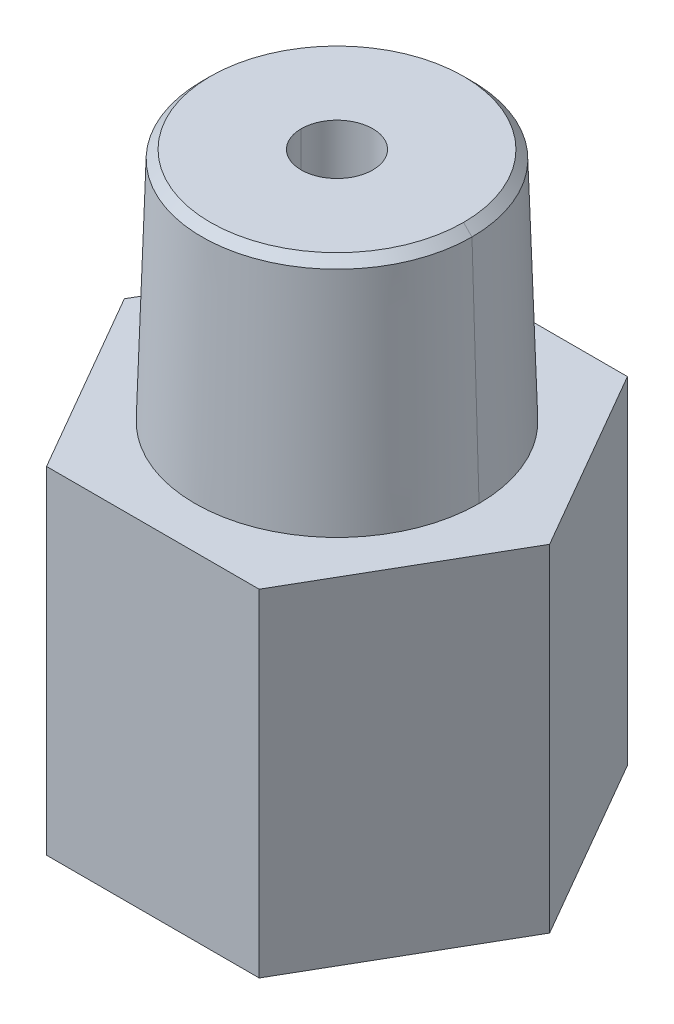
ISO-10303-21;
HEADER;
FILE_DESCRIPTION(('STEP AP214'),'2;1');
FILE_NAME('part.step','',(''),(''),'','','');
FILE_SCHEMA(('AUTOMOTIVE_DESIGN { 1 0 10303 214 1 1 1 1 }'));
ENDSEC;
DATA;
#1=APPLICATION_CONTEXT('core data for automotive mechanical design processes');
#2=APPLICATION_PROTOCOL_DEFINITION('international standard','automotive_design',2000,#1);
#3=PRODUCT_CONTEXT('',#1,'mechanical');
#4=PRODUCT('Part','Part','',(#3));
#5=PRODUCT_RELATED_PRODUCT_CATEGORY('part','',(#4));
#6=PRODUCT_DEFINITION_FORMATION('','',#4);
#7=PRODUCT_DEFINITION_CONTEXT('part definition',#1,'design');
#8=PRODUCT_DEFINITION('design','',#6,#7);
#9=PRODUCT_DEFINITION_SHAPE('','',#8);
#10=(LENGTH_UNIT() NAMED_UNIT(*) SI_UNIT(.MILLI.,.METRE.));
#11=(NAMED_UNIT(*) PLANE_ANGLE_UNIT() SI_UNIT($,.RADIAN.));
#12=(NAMED_UNIT(*) SI_UNIT($,.STERADIAN.) SOLID_ANGLE_UNIT());
#13=UNCERTAINTY_MEASURE_WITH_UNIT(LENGTH_MEASURE(1.E-05),#10,'distance_accuracy_value','');
#14=(GEOMETRIC_REPRESENTATION_CONTEXT(3) GLOBAL_UNCERTAINTY_ASSIGNED_CONTEXT((#13)) GLOBAL_UNIT_ASSIGNED_CONTEXT((#10,
#11,#12)) REPRESENTATION_CONTEXT('',''));
#15=CARTESIAN_POINT('',(0.,0.,0.));
#16=DIRECTION('',(0.,0.,1.));
#17=DIRECTION('',(1.,0.,0.));
#18=AXIS2_PLACEMENT_3D('',#15,#16,#17);
#19=CARTESIAN_POINT('',(0.,0.,0.));
#20=DIRECTION('',(0.,1.,0.));
#21=DIRECTION('',(0.,0.,1.));
#22=AXIS2_PLACEMENT_3D('',#19,#20,#21);
#23=CYLINDRICAL_SURFACE('',#22,7.1501);
#24=CARTESIAN_POINT('',(0.,15.875,0.));
#25=DIRECTION('',(0.,1.,0.));
#26=DIRECTION('',(0.,0.,1.));
#27=AXIS2_PLACEMENT_3D('',#24,#25,#26);
#28=CIRCLE('',#27,7.1501);
#29=CARTESIAN_POINT('',(-7.1501,15.875,0.));
#30=VERTEX_POINT('',#29);
#31=CARTESIAN_POINT('',(7.1501,15.875,0.));
#32=VERTEX_POINT('',#31);
#33=EDGE_CURVE('E20',#30,#32,#28,.T.);
#34=ORIENTED_EDGE('',*,*,#33,.T.);
#35=DIRECTION('',(0.,1.,0.));
#36=VECTOR('',#35,1.);
#37=CARTESIAN_POINT('',(7.1501,0.,0.));
#38=LINE('',#37,#36);
#39=CARTESIAN_POINT('',(7.15010000000084,2.36220000000018,0.));
#40=VERTEX_POINT('',#39);
#41=EDGE_CURVE('E88',#32,#40,#38,.F.);
#42=ORIENTED_EDGE('',*,*,#41,.T.);
#43=CARTESIAN_POINT('',(0.,2.36220000000024,0.));
#44=DIRECTION('',(0.,-1.,0.));
#45=DIRECTION('',(1.,0.,0.));
#46=AXIS2_PLACEMENT_3D('',#43,#44,#45);
#47=CIRCLE('',#46,7.15010000000111);
#48=CARTESIAN_POINT('',(-7.15010000000084,2.36220000000024,0.));
#49=VERTEX_POINT('',#48);
#50=EDGE_CURVE('E86',#40,#49,#47,.T.);
#51=ORIENTED_EDGE('',*,*,#50,.T.);
#52=DIRECTION('',(0.,1.,0.));
#53=VECTOR('',#52,1.);
#54=CARTESIAN_POINT('',(-7.1501,0.,0.));
#55=LINE('',#54,#53);
#56=EDGE_CURVE('E80',#49,#30,#55,.T.);
#57=ORIENTED_EDGE('',*,*,#56,.T.);
#58=EDGE_LOOP('',(#34,#42,#51,#57));
#59=FACE_BOUND('',#58,.T.);
#60=ADVANCED_FACE('F17',(#59),#23,.F.);
#61=CARTESIAN_POINT('',(0.,0.,0.));
#62=DIRECTION('',(0.,1.,0.));
#63=DIRECTION('',(0.,0.,1.));
#64=AXIS2_PLACEMENT_3D('',#61,#62,#63);
#65=CYLINDRICAL_SURFACE('',#64,7.1501);
#66=CARTESIAN_POINT('',(0.,15.875,0.));
#67=DIRECTION('',(0.,1.,0.));
#68=DIRECTION('',(0.,0.,1.));
#69=AXIS2_PLACEMENT_3D('',#66,#67,#68);
#70=CIRCLE('',#69,7.1501);
#71=EDGE_CURVE('E219',#32,#30,#70,.T.);
#72=ORIENTED_EDGE('',*,*,#71,.T.);
#73=ORIENTED_EDGE('',*,*,#56,.F.);
#74=CARTESIAN_POINT('',(0.,2.36220000000024,0.));
#75=DIRECTION('',(0.,-1.,0.));
#76=DIRECTION('',(1.,0.,0.));
#77=AXIS2_PLACEMENT_3D('',#74,#75,#76);
#78=CIRCLE('',#77,7.15010000000111);
#79=EDGE_CURVE('E215',#49,#40,#78,.T.);
#80=ORIENTED_EDGE('',*,*,#79,.T.);
#81=ORIENTED_EDGE('',*,*,#41,.F.);
#82=EDGE_LOOP('',(#72,#73,#80,#81));
#83=FACE_BOUND('',#82,.T.);
#84=ADVANCED_FACE('F240',(#83),#65,.F.);
#85=CARTESIAN_POINT('',(0.,15.875,0.));
#86=DIRECTION('',(0.,1.,0.));
#87=DIRECTION('',(0.,0.,1.));
#88=AXIS2_PLACEMENT_3D('',#85,#86,#87);
#89=PLANE('',#88);
#90=CARTESIAN_POINT('',(0.,15.875,0.));
#91=DIRECTION('',(0.,-1.,0.));
#92=DIRECTION('',(0.,0.,-1.));
#93=AXIS2_PLACEMENT_3D('',#90,#91,#92);
#94=CIRCLE('',#93,2.159);
#95=CARTESIAN_POINT('',(-2.159,15.875,0.));
#96=VERTEX_POINT('',#95);
#97=CARTESIAN_POINT('',(2.159,15.875,0.));
#98=VERTEX_POINT('',#97);
#99=EDGE_CURVE('E214',#96,#98,#94,.F.);
#100=ORIENTED_EDGE('',*,*,#99,.T.);
#101=CARTESIAN_POINT('',(0.,15.875,0.));
#102=DIRECTION('',(0.,-1.,0.));
#103=DIRECTION('',(0.,0.,-1.));
#104=AXIS2_PLACEMENT_3D('',#101,#102,#103);
#105=CIRCLE('',#104,2.159);
#106=EDGE_CURVE('E208',#98,#96,#105,.F.);
#107=ORIENTED_EDGE('',*,*,#106,.T.);
#108=EDGE_LOOP('',(#100,#107));
#109=FACE_BOUND('',#108,.T.);
#110=ORIENTED_EDGE('',*,*,#33,.F.);
#111=ORIENTED_EDGE('',*,*,#71,.F.);
#112=EDGE_LOOP('',(#110,#111));
#113=FACE_BOUND('',#112,.T.);
#114=ADVANCED_FACE('F243',(#109,#113),#89,.F.);
#115=CARTESIAN_POINT('',(0.,2.7972416050126E-13,0.));
#116=DIRECTION('',(0.,-1.,0.));
#117=DIRECTION('',(0.,0.,-1.));
#118=AXIS2_PLACEMENT_3D('',#115,#116,#117);
#119=CONICAL_SURFACE('',#118,7.65220110997794,0.20943951023928);
#120=ORIENTED_EDGE('',*,*,#50,.F.);
#121=DIRECTION('',(-0.207911690817721,0.978147600733814,0.));
#122=VECTOR('',#121,1.);
#123=CARTESIAN_POINT('',(7.40115055498958,1.1811,0.));
#124=LINE('',#123,#122);
#125=CARTESIAN_POINT('',(7.65220110997794,2.77555756156289E-13,0.));
#126=VERTEX_POINT('',#125);
#127=EDGE_CURVE('E212',#40,#126,#124,.F.);
#128=ORIENTED_EDGE('',*,*,#127,.T.);
#129=CARTESIAN_POINT('',(0.,2.77555756156289E-13,0.));
#130=DIRECTION('',(0.,-1.,0.));
#131=DIRECTION('',(0.,0.,-1.));
#132=AXIS2_PLACEMENT_3D('',#129,#130,#131);
#133=CIRCLE('',#132,7.65220110997794);
#134=CARTESIAN_POINT('',(-7.65220110997794,2.77555756156289E-13,0.));
#135=VERTEX_POINT('',#134);
#136=EDGE_CURVE('E211',#126,#135,#133,.T.);
#137=ORIENTED_EDGE('',*,*,#136,.T.);
#138=DIRECTION('',(0.207911690817721,0.978147600733814,0.));
#139=VECTOR('',#138,1.);
#140=CARTESIAN_POINT('',(-7.40115055498958,1.1811,0.));
#141=LINE('',#140,#139);
#142=EDGE_CURVE('E216',#135,#49,#141,.T.);
#143=ORIENTED_EDGE('',*,*,#142,.T.);
#144=EDGE_LOOP('',(#120,#128,#137,#143));
#145=FACE_BOUND('',#144,.T.);
#146=ADVANCED_FACE('F245',(#145),#119,.F.);
#147=CARTESIAN_POINT('',(0.,2.7972416050126E-13,0.));
#148=DIRECTION('',(0.,-1.,0.));
#149=DIRECTION('',(0.,0.,-1.));
#150=AXIS2_PLACEMENT_3D('',#147,#148,#149);
#151=CONICAL_SURFACE('',#150,7.65220110997794,0.20943951023928);
#152=ORIENTED_EDGE('',*,*,#79,.F.);
#153=ORIENTED_EDGE('',*,*,#142,.F.);
#154=CARTESIAN_POINT('',(0.,2.77555756156289E-13,0.));
#155=DIRECTION('',(0.,-1.,0.));
#156=DIRECTION('',(0.,0.,-1.));
#157=AXIS2_PLACEMENT_3D('',#154,#155,#156);
#158=CIRCLE('',#157,7.65220110997794);
#159=EDGE_CURVE('E233',#135,#126,#158,.T.);
#160=ORIENTED_EDGE('',*,*,#159,.T.);
#161=ORIENTED_EDGE('',*,*,#127,.F.);
#162=EDGE_LOOP('',(#152,#153,#160,#161));
#163=FACE_BOUND('',#162,.T.);
#164=ADVANCED_FACE('F253',(#163),#151,.F.);
#165=CARTESIAN_POINT('',(0.,34.544,0.));
#166=DIRECTION('',(0.,-1.,0.));
#167=DIRECTION('',(0.,0.,-1.));
#168=AXIS2_PLACEMENT_3D('',#165,#166,#167);
#169=CYLINDRICAL_SURFACE('',#168,2.159);
#170=CARTESIAN_POINT('',(0.,34.544,0.));
#171=DIRECTION('',(0.,-1.,0.));
#172=DIRECTION('',(0.,0.,-1.));
#173=AXIS2_PLACEMENT_3D('',#170,#171,#172);
#174=CIRCLE('',#173,2.159);
#175=CARTESIAN_POINT('',(-2.159,34.544,0.));
#176=VERTEX_POINT('',#175);
#177=CARTESIAN_POINT('',(2.159,34.544,0.));
#178=VERTEX_POINT('',#177);
#179=EDGE_CURVE('E231',#176,#178,#174,.F.);
#180=ORIENTED_EDGE('',*,*,#179,.T.);
#181=DIRECTION('',(0.,-1.,0.));
#182=VECTOR('',#181,1.);
#183=CARTESIAN_POINT('',(2.159,34.544,0.));
#184=LINE('',#183,#182);
#185=EDGE_CURVE('E207',#178,#98,#184,.T.);
#186=ORIENTED_EDGE('',*,*,#185,.T.);
#187=ORIENTED_EDGE('',*,*,#99,.F.);
#188=DIRECTION('',(0.,-1.,0.));
#189=VECTOR('',#188,1.);
#190=CARTESIAN_POINT('',(-2.159,34.544,0.));
#191=LINE('',#190,#189);
#192=EDGE_CURVE('E205',#96,#176,#191,.F.);
#193=ORIENTED_EDGE('',*,*,#192,.T.);
#194=EDGE_LOOP('',(#180,#186,#187,#193));
#195=FACE_BOUND('',#194,.T.);
#196=ADVANCED_FACE('F308',(#195),#169,.F.);
#197=CARTESIAN_POINT('',(0.,34.544,0.));
#198=DIRECTION('',(0.,-1.,0.));
#199=DIRECTION('',(0.,0.,-1.));
#200=AXIS2_PLACEMENT_3D('',#197,#198,#199);
#201=CYLINDRICAL_SURFACE('',#200,2.159);
#202=CARTESIAN_POINT('',(0.,34.544,0.));
#203=DIRECTION('',(0.,-1.,0.));
#204=DIRECTION('',(0.,0.,-1.));
#205=AXIS2_PLACEMENT_3D('',#202,#203,#204);
#206=CIRCLE('',#205,2.159);
#207=EDGE_CURVE('E228',#178,#176,#206,.F.);
#208=ORIENTED_EDGE('',*,*,#207,.T.);
#209=ORIENTED_EDGE('',*,*,#192,.F.);
#210=ORIENTED_EDGE('',*,*,#106,.F.);
#211=ORIENTED_EDGE('',*,*,#185,.F.);
#212=EDGE_LOOP('',(#208,#209,#210,#211));
#213=FACE_BOUND('',#212,.T.);
#214=ADVANCED_FACE('F304',(#213),#201,.F.);
#215=CARTESIAN_POINT('',(0.,0.,0.));
#216=DIRECTION('',(0.,1.,0.));
#217=DIRECTION('',(0.,0.,1.));
#218=AXIS2_PLACEMENT_3D('',#215,#216,#217);
#219=PLANE('',#218);
#220=ORIENTED_EDGE('',*,*,#136,.F.);
#221=ORIENTED_EDGE('',*,*,#159,.F.);
#222=EDGE_LOOP('',(#220,#221));
#223=FACE_BOUND('',#222,.T.);
#224=DIRECTION('',(-0.500000000000017,0.,0.866025403784429));
#225=VECTOR('',#224,1.);
#226=CARTESIAN_POINT('',(-6.4158048663707,0.,-11.1125));
#227=LINE('',#226,#225);
#228=CARTESIAN_POINT('',(-6.4158048663707,0.,-11.1125));
#229=VERTEX_POINT('',#228);
#230=CARTESIAN_POINT('',(-12.8316097327396,0.,-3.97970932965632E-13));
#231=VERTEX_POINT('',#230);
#232=EDGE_CURVE('E187',#229,#231,#227,.T.);
#233=ORIENTED_EDGE('',*,*,#232,.F.);
#234=DIRECTION('',(-1.,0.,0.));
#235=VECTOR('',#234,1.);
#236=CARTESIAN_POINT('',(6.4158048663707,0.,-11.1125));
#237=LINE('',#236,#235);
#238=CARTESIAN_POINT('',(6.41580486637001,0.,-11.1124999999996));
#239=VERTEX_POINT('',#238);
#240=EDGE_CURVE('E192',#239,#229,#237,.T.);
#241=ORIENTED_EDGE('',*,*,#240,.F.);
#242=DIRECTION('',(-0.500000000000017,0.,-0.866025403784429));
#243=VECTOR('',#242,1.);
#244=CARTESIAN_POINT('',(12.8316097327389,0.,0.));
#245=LINE('',#244,#243);
#246=CARTESIAN_POINT('',(12.8316097327396,0.,3.97970932965632E-13));
#247=VERTEX_POINT('',#246);
#248=EDGE_CURVE('E197',#247,#239,#245,.T.);
#249=ORIENTED_EDGE('',*,*,#248,.F.);
#250=DIRECTION('',(0.500000000000017,0.,-0.866025403784429));
#251=VECTOR('',#250,1.);
#252=CARTESIAN_POINT('',(6.4158048663707,0.,11.1125));
#253=LINE('',#252,#251);
#254=CARTESIAN_POINT('',(6.4158048663707,0.,11.1125));
#255=VERTEX_POINT('',#254);
#256=EDGE_CURVE('E202',#255,#247,#253,.T.);
#257=ORIENTED_EDGE('',*,*,#256,.F.);
#258=DIRECTION('',(1.,0.,0.));
#259=VECTOR('',#258,1.);
#260=CARTESIAN_POINT('',(-6.4158048663707,0.,11.1125));
#261=LINE('',#260,#259);
#262=CARTESIAN_POINT('',(-6.41580486637001,0.,11.1124999999996));
#263=VERTEX_POINT('',#262);
#264=EDGE_CURVE('E139',#263,#255,#261,.T.);
#265=ORIENTED_EDGE('',*,*,#264,.F.);
#266=DIRECTION('',(0.500000000000017,0.,0.866025403784429));
#267=VECTOR('',#266,1.);
#268=CARTESIAN_POINT('',(-12.8316097327389,0.,0.));
#269=LINE('',#268,#267);
#270=EDGE_CURVE('E135',#231,#263,#269,.T.);
#271=ORIENTED_EDGE('',*,*,#270,.F.);
#272=EDGE_LOOP('',(#233,#241,#249,#257,#265,#271));
#273=FACE_BOUND('',#272,.T.);
#274=ADVANCED_FACE('F300',(#223,#273),#219,.F.);
#275=CARTESIAN_POINT('',(0.,34.544,0.));
#276=DIRECTION('',(0.,-1.,0.));
#277=DIRECTION('',(0.,0.,-1.));
#278=AXIS2_PLACEMENT_3D('',#275,#276,#277);
#279=PLANE('',#278);
#280=ORIENTED_EDGE('',*,*,#179,.F.);
#281=ORIENTED_EDGE('',*,*,#207,.F.);
#282=EDGE_LOOP('',(#280,#281));
#283=FACE_BOUND('',#282,.T.);
#284=CARTESIAN_POINT('',(0.,34.544,0.));
#285=DIRECTION('',(0.,-1.,0.));
#286=DIRECTION('',(0.,0.,-1.));
#287=AXIS2_PLACEMENT_3D('',#284,#285,#286);
#288=CIRCLE('',#287,7.63824979824256);
#289=CARTESIAN_POINT('',(-7.63824979824256,34.544,0.));
#290=VERTEX_POINT('',#289);
#291=CARTESIAN_POINT('',(7.63824979824256,34.544,0.));
#292=VERTEX_POINT('',#291);
#293=EDGE_CURVE('E204',#290,#292,#288,.T.);
#294=ORIENTED_EDGE('',*,*,#293,.F.);
#295=CARTESIAN_POINT('',(0.,34.544,0.));
#296=DIRECTION('',(0.,-1.,0.));
#297=DIRECTION('',(0.,0.,-1.));
#298=AXIS2_PLACEMENT_3D('',#295,#296,#297);
#299=CIRCLE('',#298,7.63824979824256);
#300=EDGE_CURVE('E179',#292,#290,#299,.T.);
#301=ORIENTED_EDGE('',*,*,#300,.F.);
#302=EDGE_LOOP('',(#294,#301));
#303=FACE_BOUND('',#302,.T.);
#304=ADVANCED_FACE('F296',(#283,#303),#279,.F.);
#305=CARTESIAN_POINT('',(0.,34.036,0.));
#306=DIRECTION('',(0.,-1.,0.));
#307=DIRECTION('',(0.,0.,-1.));
#308=AXIS2_PLACEMENT_3D('',#305,#306,#307);
#309=CONICAL_SURFACE('',#308,8.14624979824248,0.785398163397301);
#310=ORIENTED_EDGE('',*,*,#293,.T.);
#311=DIRECTION('',(-0.707106781186443,0.707106781186652,0.));
#312=VECTOR('',#311,1.);
#313=CARTESIAN_POINT('',(7.89224979824252,34.29,0.));
#314=LINE('',#313,#312);
#315=CARTESIAN_POINT('',(8.14624979824277,34.036,0.));
#316=VERTEX_POINT('',#315);
#317=EDGE_CURVE('E173',#316,#292,#314,.T.);
#318=ORIENTED_EDGE('',*,*,#317,.F.);
#319=CARTESIAN_POINT('',(0.,34.036,0.));
#320=DIRECTION('',(0.,-1.,0.));
#321=DIRECTION('',(-1.,0.,0.));
#322=AXIS2_PLACEMENT_3D('',#319,#320,#321);
#323=CIRCLE('',#322,8.14624979824282);
#324=CARTESIAN_POINT('',(-8.14624979824274,34.036,0.));
#325=VERTEX_POINT('',#324);
#326=EDGE_CURVE('E164',#325,#316,#323,.T.);
#327=ORIENTED_EDGE('',*,*,#326,.F.);
#328=DIRECTION('',(0.707106781186443,0.707106781186652,0.));
#329=VECTOR('',#328,1.);
#330=CARTESIAN_POINT('',(-7.89224979824252,34.29,0.));
#331=LINE('',#330,#329);
#332=EDGE_CURVE('E176',#290,#325,#331,.F.);
#333=ORIENTED_EDGE('',*,*,#332,.F.);
#334=EDGE_LOOP('',(#310,#318,#327,#333));
#335=FACE_BOUND('',#334,.T.);
#336=ADVANCED_FACE('F292',(#335),#309,.T.);
#337=CARTESIAN_POINT('',(6.4158048663707,0.,11.1125));
#338=DIRECTION('',(0.866025403784429,0.,0.500000000000017));
#339=DIRECTION('',(0.500000000000017,0.,-0.866025403784429));
#340=AXIS2_PLACEMENT_3D('',#337,#338,#339);
#341=PLANE('',#340);
#342=DIRECTION('',(0.,1.,0.));
#343=VECTOR('',#342,1.);
#344=CARTESIAN_POINT('',(6.4158048663707,0.,11.1125));
#345=LINE('',#344,#343);
#346=CARTESIAN_POINT('',(6.4158048663707,20.32,11.1125));
#347=VERTEX_POINT('',#346);
#348=EDGE_CURVE('E140',#255,#347,#345,.T.);
#349=ORIENTED_EDGE('',*,*,#348,.F.);
#350=ORIENTED_EDGE('',*,*,#256,.T.);
#351=DIRECTION('',(0.,1.,0.));
#352=VECTOR('',#351,1.);
#353=CARTESIAN_POINT('',(12.8316097327389,0.,0.));
#354=LINE('',#353,#352);
#355=CARTESIAN_POINT('',(12.8316097327396,20.32,3.97970932965632E-13));
#356=VERTEX_POINT('',#355);
#357=EDGE_CURVE('E199',#356,#247,#354,.F.);
#358=ORIENTED_EDGE('',*,*,#357,.F.);
#359=DIRECTION('',(0.499999999999909,0.,-0.866025403784491));
#360=VECTOR('',#359,1.);
#361=CARTESIAN_POINT('',(6.4158048663707,20.32,11.1125));
#362=LINE('',#361,#360);
#363=EDGE_CURVE('E162',#347,#356,#362,.T.);
#364=ORIENTED_EDGE('',*,*,#363,.F.);
#365=EDGE_LOOP('',(#349,#350,#358,#364));
#366=FACE_BOUND('',#365,.T.);
#367=ADVANCED_FACE('F288',(#366),#341,.T.);
#368=CARTESIAN_POINT('',(12.8316097327389,0.,0.));
#369=DIRECTION('',(0.866025403784429,0.,-0.500000000000017));
#370=DIRECTION('',(-0.500000000000017,0.,-0.866025403784429));
#371=AXIS2_PLACEMENT_3D('',#368,#369,#370);
#372=PLANE('',#371);
#373=ORIENTED_EDGE('',*,*,#357,.T.);
#374=ORIENTED_EDGE('',*,*,#248,.T.);
#375=DIRECTION('',(0.,1.,0.));
#376=VECTOR('',#375,1.);
#377=CARTESIAN_POINT('',(6.4158048663707,0.,-11.1125));
#378=LINE('',#377,#376);
#379=CARTESIAN_POINT('',(6.41580486637001,20.32,-11.1124999999996));
#380=VERTEX_POINT('',#379);
#381=EDGE_CURVE('E194',#380,#239,#378,.F.);
#382=ORIENTED_EDGE('',*,*,#381,.F.);
#383=DIRECTION('',(-0.499999999999909,0.,-0.866025403784491));
#384=VECTOR('',#383,1.);
#385=CARTESIAN_POINT('',(12.8316097327389,20.32,0.));
#386=LINE('',#385,#384);
#387=EDGE_CURVE('E159',#356,#380,#386,.T.);
#388=ORIENTED_EDGE('',*,*,#387,.F.);
#389=EDGE_LOOP('',(#373,#374,#382,#388));
#390=FACE_BOUND('',#389,.T.);
#391=ADVANCED_FACE('F284',(#390),#372,.T.);
#392=CARTESIAN_POINT('',(6.4158048663707,0.,-11.1125));
#393=DIRECTION('',(0.,0.,-1.));
#394=DIRECTION('',(-1.,0.,0.));
#395=AXIS2_PLACEMENT_3D('',#392,#393,#394);
#396=PLANE('',#395);
#397=ORIENTED_EDGE('',*,*,#381,.T.);
#398=ORIENTED_EDGE('',*,*,#240,.T.);
#399=DIRECTION('',(0.,1.,0.));
#400=VECTOR('',#399,1.);
#401=CARTESIAN_POINT('',(-6.4158048663707,0.,-11.1125));
#402=LINE('',#401,#400);
#403=CARTESIAN_POINT('',(-6.4158048663707,20.32,-11.1125));
#404=VERTEX_POINT('',#403);
#405=EDGE_CURVE('E189',#404,#229,#402,.F.);
#406=ORIENTED_EDGE('',*,*,#405,.F.);
#407=DIRECTION('',(1.,0.,0.));
#408=VECTOR('',#407,1.);
#409=CARTESIAN_POINT('',(0.,20.32,-11.1125));
#410=LINE('',#409,#408);
#411=EDGE_CURVE('E155',#380,#404,#410,.F.);
#412=ORIENTED_EDGE('',*,*,#411,.F.);
#413=EDGE_LOOP('',(#397,#398,#406,#412));
#414=FACE_BOUND('',#413,.T.);
#415=ADVANCED_FACE('F280',(#414),#396,.T.);
#416=CARTESIAN_POINT('',(-6.4158048663707,0.,-11.1125));
#417=DIRECTION('',(-0.866025403784429,0.,-0.500000000000017));
#418=DIRECTION('',(-0.500000000000017,0.,0.866025403784429));
#419=AXIS2_PLACEMENT_3D('',#416,#417,#418);
#420=PLANE('',#419);
#421=ORIENTED_EDGE('',*,*,#405,.T.);
#422=ORIENTED_EDGE('',*,*,#232,.T.);
#423=DIRECTION('',(0.,1.,0.));
#424=VECTOR('',#423,1.);
#425=CARTESIAN_POINT('',(-12.8316097327389,0.,0.));
#426=LINE('',#425,#424);
#427=CARTESIAN_POINT('',(-12.8316097327396,20.32,-3.97970932965632E-13));
#428=VERTEX_POINT('',#427);
#429=EDGE_CURVE('E185',#428,#231,#426,.F.);
#430=ORIENTED_EDGE('',*,*,#429,.F.);
#431=DIRECTION('',(-0.499999999999909,0.,0.866025403784491));
#432=VECTOR('',#431,1.);
#433=CARTESIAN_POINT('',(-6.4158048663707,20.32,-11.1125));
#434=LINE('',#433,#432);
#435=EDGE_CURVE('E153',#404,#428,#434,.T.);
#436=ORIENTED_EDGE('',*,*,#435,.F.);
#437=EDGE_LOOP('',(#421,#422,#430,#436));
#438=FACE_BOUND('',#437,.T.);
#439=ADVANCED_FACE('F277',(#438),#420,.T.);
#440=CARTESIAN_POINT('',(-12.8316097327389,0.,0.));
#441=DIRECTION('',(-0.866025403784429,0.,0.500000000000017));
#442=DIRECTION('',(0.500000000000017,0.,0.866025403784429));
#443=AXIS2_PLACEMENT_3D('',#440,#441,#442);
#444=PLANE('',#443);
#445=ORIENTED_EDGE('',*,*,#429,.T.);
#446=ORIENTED_EDGE('',*,*,#270,.T.);
#447=DIRECTION('',(0.,1.,0.));
#448=VECTOR('',#447,1.);
#449=CARTESIAN_POINT('',(-6.4158048663707,0.,11.1125));
#450=LINE('',#449,#448);
#451=CARTESIAN_POINT('',(-6.41580486637001,20.32,11.1124999999996));
#452=VERTEX_POINT('',#451);
#453=EDGE_CURVE('E127',#452,#263,#450,.F.);
#454=ORIENTED_EDGE('',*,*,#453,.F.);
#455=DIRECTION('',(0.499999999999909,0.,0.866025403784491));
#456=VECTOR('',#455,1.);
#457=CARTESIAN_POINT('',(-12.8316097327389,20.32,0.));
#458=LINE('',#457,#456);
#459=EDGE_CURVE('E132',#428,#452,#458,.T.);
#460=ORIENTED_EDGE('',*,*,#459,.F.);
#461=EDGE_LOOP('',(#445,#446,#454,#460));
#462=FACE_BOUND('',#461,.T.);
#463=ADVANCED_FACE('F130',(#462),#444,.T.);
#464=CARTESIAN_POINT('',(-6.4158048663707,0.,11.1125));
#465=DIRECTION('',(0.,0.,1.));
#466=DIRECTION('',(1.,0.,0.));
#467=AXIS2_PLACEMENT_3D('',#464,#465,#466);
#468=PLANE('',#467);
#469=ORIENTED_EDGE('',*,*,#453,.T.);
#470=ORIENTED_EDGE('',*,*,#264,.T.);
#471=ORIENTED_EDGE('',*,*,#348,.T.);
#472=DIRECTION('',(1.,0.,0.));
#473=VECTOR('',#472,1.);
#474=CARTESIAN_POINT('',(0.,20.32,11.1125));
#475=LINE('',#474,#473);
#476=EDGE_CURVE('E144',#452,#347,#475,.T.);
#477=ORIENTED_EDGE('',*,*,#476,.F.);
#478=EDGE_LOOP('',(#469,#470,#471,#477));
#479=FACE_BOUND('',#478,.T.);
#480=ADVANCED_FACE('F145',(#479),#468,.T.);
#481=CARTESIAN_POINT('',(0.,34.036,0.));
#482=DIRECTION('',(0.,-1.,0.));
#483=DIRECTION('',(0.,0.,-1.));
#484=AXIS2_PLACEMENT_3D('',#481,#482,#483);
#485=CONICAL_SURFACE('',#484,8.14624979824248,0.785398163397301);
#486=CARTESIAN_POINT('',(0.,34.036,0.));
#487=DIRECTION('',(0.,-1.,0.));
#488=DIRECTION('',(-1.,0.,0.));
#489=AXIS2_PLACEMENT_3D('',#486,#487,#488);
#490=CIRCLE('',#489,8.14624979824282);
#491=EDGE_CURVE('E167',#316,#325,#490,.T.);
#492=ORIENTED_EDGE('',*,*,#491,.F.);
#493=ORIENTED_EDGE('',*,*,#317,.T.);
#494=ORIENTED_EDGE('',*,*,#300,.T.);
#495=ORIENTED_EDGE('',*,*,#332,.T.);
#496=EDGE_LOOP('',(#492,#493,#494,#495));
#497=FACE_BOUND('',#496,.T.);
#498=ADVANCED_FACE('F269',(#497),#485,.T.);
#499=CARTESIAN_POINT('',(0.,20.32,0.));
#500=DIRECTION('',(0.,-1.,0.));
#501=DIRECTION('',(0.,0.,-1.));
#502=AXIS2_PLACEMENT_3D('',#499,#500,#501);
#503=CONICAL_SURFACE('',#502,8.5724999999997,0.0310668606854932);
#504=DIRECTION('',(-0.0310618635640815,0.999517463895417,0.));
#505=VECTOR('',#504,1.);
#506=CARTESIAN_POINT('',(8.35937489912126,27.178,0.));
#507=LINE('',#506,#505);
#508=CARTESIAN_POINT('',(8.5724999999997,20.32,0.));
#509=VERTEX_POINT('',#508);
#510=EDGE_CURVE('E168',#509,#316,#507,.T.);
#511=ORIENTED_EDGE('',*,*,#510,.F.);
#512=CARTESIAN_POINT('',(0.,20.32,0.));
#513=DIRECTION('',(0.,-1.,0.));
#514=DIRECTION('',(0.,0.,-1.));
#515=AXIS2_PLACEMENT_3D('',#512,#513,#514);
#516=CIRCLE('',#515,8.5724999999997);
#517=CARTESIAN_POINT('',(-8.5724999999997,20.32,0.));
#518=VERTEX_POINT('',#517);
#519=EDGE_CURVE('E35',#518,#509,#516,.T.);
#520=ORIENTED_EDGE('',*,*,#519,.F.);
#521=DIRECTION('',(0.0310618635640815,0.999517463895417,0.));
#522=VECTOR('',#521,1.);
#523=CARTESIAN_POINT('',(-8.35937489912126,27.178,0.));
#524=LINE('',#523,#522);
#525=EDGE_CURVE('E26',#325,#518,#524,.F.);
#526=ORIENTED_EDGE('',*,*,#525,.F.);
#527=ORIENTED_EDGE('',*,*,#326,.T.);
#528=EDGE_LOOP('',(#511,#520,#526,#527));
#529=FACE_BOUND('',#528,.T.);
#530=ADVANCED_FACE('F263',(#529),#503,.T.);
#531=CARTESIAN_POINT('',(0.,20.32,0.));
#532=DIRECTION('',(0.,1.,0.));
#533=DIRECTION('',(0.,0.,1.));
#534=AXIS2_PLACEMENT_3D('',#531,#532,#533);
#535=PLANE('',#534);
#536=ORIENTED_EDGE('',*,*,#519,.T.);
#537=CARTESIAN_POINT('',(0.,20.32,0.));
#538=DIRECTION('',(0.,-1.,0.));
#539=DIRECTION('',(0.,0.,-1.));
#540=AXIS2_PLACEMENT_3D('',#537,#538,#539);
#541=CIRCLE('',#540,8.5724999999997);
#542=EDGE_CURVE('E11',#518,#509,#541,.F.);
#543=ORIENTED_EDGE('',*,*,#542,.F.);
#544=EDGE_LOOP('',(#536,#543));
#545=FACE_BOUND('',#544,.T.);
#546=ORIENTED_EDGE('',*,*,#459,.T.);
#547=ORIENTED_EDGE('',*,*,#476,.T.);
#548=ORIENTED_EDGE('',*,*,#363,.T.);
#549=ORIENTED_EDGE('',*,*,#387,.T.);
#550=ORIENTED_EDGE('',*,*,#411,.T.);
#551=ORIENTED_EDGE('',*,*,#435,.T.);
#552=EDGE_LOOP('',(#546,#547,#548,#549,#550,#551));
#553=FACE_BOUND('',#552,.T.);
#554=ADVANCED_FACE('F150',(#545,#553),#535,.T.);
#555=CARTESIAN_POINT('',(0.,20.32,0.));
#556=DIRECTION('',(0.,-1.,0.));
#557=DIRECTION('',(0.,0.,-1.));
#558=AXIS2_PLACEMENT_3D('',#555,#556,#557);
#559=CONICAL_SURFACE('',#558,8.5724999999997,0.0310668606854932);
#560=ORIENTED_EDGE('',*,*,#525,.T.);
#561=ORIENTED_EDGE('',*,*,#542,.T.);
#562=ORIENTED_EDGE('',*,*,#510,.T.);
#563=ORIENTED_EDGE('',*,*,#491,.T.);
#564=EDGE_LOOP('',(#560,#561,#562,#563));
#565=FACE_BOUND('',#564,.T.);
#566=ADVANCED_FACE('F256',(#565),#559,.T.);
#567=CLOSED_SHELL('',(#60,#84,#114,#146,#164,#196,#214,#274,#304,#336,#367,#391,#415,#439,#463,
#480,#498,#530,#554,#566));
#568=MANIFOLD_SOLID_BREP('B1',#567);
#569=ADVANCED_BREP_SHAPE_REPRESENTATION('',(#18,#568),#14);
#570=SHAPE_DEFINITION_REPRESENTATION(#9,#569);
ENDSEC;
END-ISO-10303-21;
